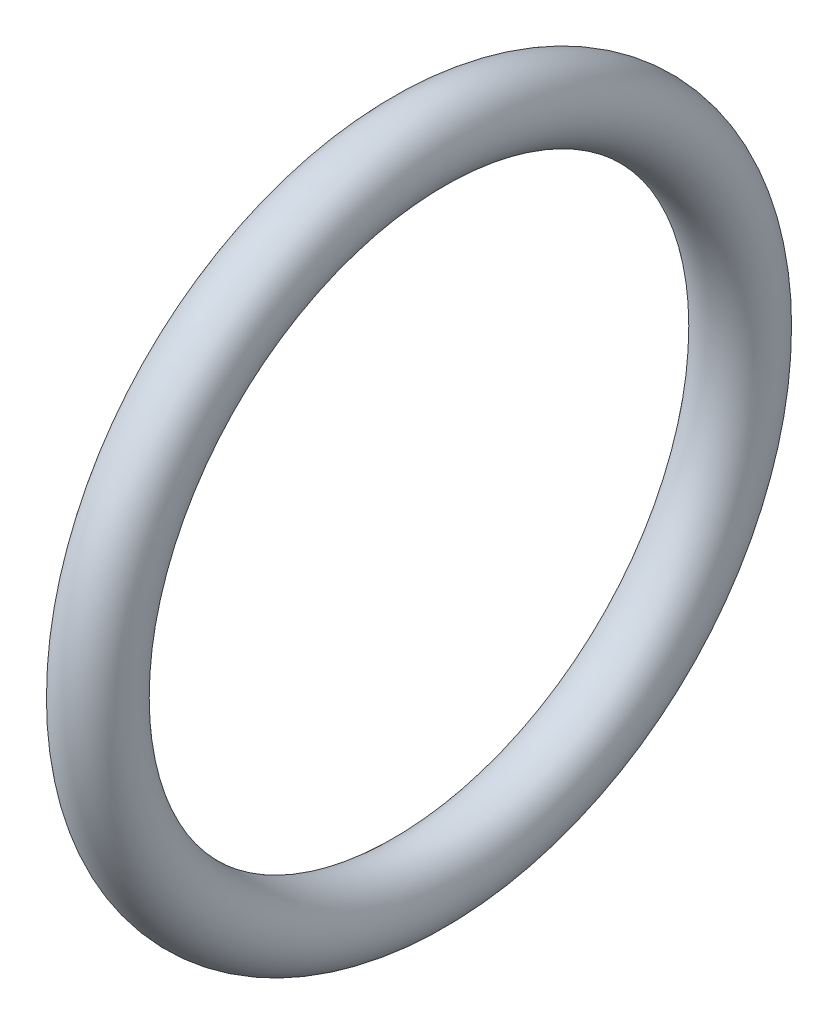
ISO-10303-21;
HEADER;
FILE_DESCRIPTION(('STEP AP214'),'2;1');
FILE_NAME('part.step','',(''),(''),'','','');
FILE_SCHEMA(('AUTOMOTIVE_DESIGN { 1 0 10303 214 1 1 1 1 }'));
ENDSEC;
DATA;
#1=APPLICATION_CONTEXT('core data for automotive mechanical design processes');
#2=APPLICATION_PROTOCOL_DEFINITION('international standard','automotive_design',2000,#1);
#3=PRODUCT_CONTEXT('',#1,'mechanical');
#4=PRODUCT('Part','Part','',(#3));
#5=PRODUCT_RELATED_PRODUCT_CATEGORY('part','',(#4));
#6=PRODUCT_DEFINITION_FORMATION('','',#4);
#7=PRODUCT_DEFINITION_CONTEXT('part definition',#1,'design');
#8=PRODUCT_DEFINITION('design','',#6,#7);
#9=PRODUCT_DEFINITION_SHAPE('','',#8);
#10=(LENGTH_UNIT() NAMED_UNIT(*) SI_UNIT(.MILLI.,.METRE.));
#11=(NAMED_UNIT(*) PLANE_ANGLE_UNIT() SI_UNIT($,.RADIAN.));
#12=(NAMED_UNIT(*) SI_UNIT($,.STERADIAN.) SOLID_ANGLE_UNIT());
#13=UNCERTAINTY_MEASURE_WITH_UNIT(LENGTH_MEASURE(1.E-05),#10,'distance_accuracy_value','');
#14=(GEOMETRIC_REPRESENTATION_CONTEXT(3) GLOBAL_UNCERTAINTY_ASSIGNED_CONTEXT((#13)) GLOBAL_UNIT_ASSIGNED_CONTEXT((#10,
#11,#12)) REPRESENTATION_CONTEXT('',''));
#15=CARTESIAN_POINT('',(0.,0.,0.));
#16=DIRECTION('',(0.,0.,1.));
#17=DIRECTION('',(1.,0.,0.));
#18=AXIS2_PLACEMENT_3D('',#15,#16,#17);
#19=CARTESIAN_POINT('',(2.54,0.,0.));
#20=DIRECTION('',(-1.,0.,0.));
#21=DIRECTION('',(0.,0.,1.));
#22=AXIS2_PLACEMENT_3D('',#19,#20,#21);
#23=TOROIDAL_SURFACE('',#22,6.731,0.762);
#24=CARTESIAN_POINT('',(2.54,0.,7.493));
#25=VERTEX_POINT('',#24);
#26=VERTEX_LOOP('',#25);
#27=FACE_BOUND('',#26,.T.);
#28=ADVANCED_FACE('F31',(#27),#23,.T.);
#29=CLOSED_SHELL('',(#28));
#30=MANIFOLD_SOLID_BREP('B2',#29);
#31=ADVANCED_BREP_SHAPE_REPRESENTATION('',(#18,#30),#14);
#32=SHAPE_DEFINITION_REPRESENTATION(#9,#31);
ENDSEC;
END-ISO-10303-21;
